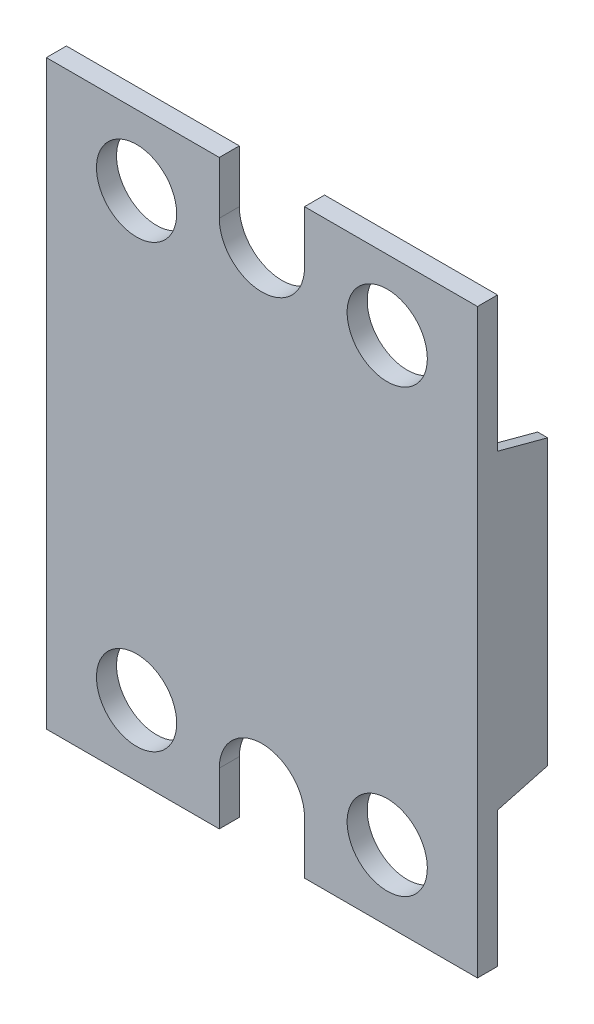
ISO-10303-21;
HEADER;
FILE_DESCRIPTION(('STEP AP214'),'2;1');
FILE_NAME('part.step','',(''),(''),'','','');
FILE_SCHEMA(('AUTOMOTIVE_DESIGN { 1 0 10303 214 1 1 1 1 }'));
ENDSEC;
DATA;
#1=APPLICATION_CONTEXT('core data for automotive mechanical design processes');
#2=APPLICATION_PROTOCOL_DEFINITION('international standard','automotive_design',2000,#1);
#3=PRODUCT_CONTEXT('',#1,'mechanical');
#4=PRODUCT('Part','Part','',(#3));
#5=PRODUCT_RELATED_PRODUCT_CATEGORY('part','',(#4));
#6=PRODUCT_DEFINITION_FORMATION('','',#4);
#7=PRODUCT_DEFINITION_CONTEXT('part definition',#1,'design');
#8=PRODUCT_DEFINITION('design','',#6,#7);
#9=PRODUCT_DEFINITION_SHAPE('','',#8);
#10=(LENGTH_UNIT() NAMED_UNIT(*) SI_UNIT(.MILLI.,.METRE.));
#11=(NAMED_UNIT(*) PLANE_ANGLE_UNIT() SI_UNIT($,.RADIAN.));
#12=(NAMED_UNIT(*) SI_UNIT($,.STERADIAN.) SOLID_ANGLE_UNIT());
#13=UNCERTAINTY_MEASURE_WITH_UNIT(LENGTH_MEASURE(1.E-05),#10,'distance_accuracy_value','');
#14=(GEOMETRIC_REPRESENTATION_CONTEXT(3) GLOBAL_UNCERTAINTY_ASSIGNED_CONTEXT((#13)) GLOBAL_UNIT_ASSIGNED_CONTEXT((#10,
#11,#12)) REPRESENTATION_CONTEXT('',''));
#15=CARTESIAN_POINT('',(0.,0.,0.));
#16=DIRECTION('',(0.,0.,1.));
#17=DIRECTION('',(1.,0.,0.));
#18=AXIS2_PLACEMENT_3D('',#15,#16,#17);
#19=CARTESIAN_POINT('',(0.,-23.75,-2.));
#20=DIRECTION('',(0.,0.,-1.));
#21=DIRECTION('',(-1.,0.,0.));
#22=AXIS2_PLACEMENT_3D('',#19,#20,#21);
#23=PLANE('',#22);
#24=CARTESIAN_POINT('',(12.5,22.,-2.));
#25=DIRECTION('',(0.,0.,1.));
#26=DIRECTION('',(1.,0.,0.));
#27=AXIS2_PLACEMENT_3D('',#24,#25,#26);
#28=CIRCLE('',#27,4.);
#29=CARTESIAN_POINT('',(16.5,22.,-2.));
#30=VERTEX_POINT('',#29);
#31=EDGE_CURVE('E290',#30,#30,#28,.T.);
#32=ORIENTED_EDGE('',*,*,#31,.T.);
#33=EDGE_LOOP('',(#32));
#34=FACE_BOUND('',#33,.T.);
#35=CARTESIAN_POINT('',(-12.5,22.,-2.));
#36=DIRECTION('',(0.,0.,1.));
#37=DIRECTION('',(1.,0.,0.));
#38=AXIS2_PLACEMENT_3D('',#35,#36,#37);
#39=CIRCLE('',#38,4.);
#40=CARTESIAN_POINT('',(-8.5,22.,-2.));
#41=VERTEX_POINT('',#40);
#42=EDGE_CURVE('E357',#41,#41,#39,.T.);
#43=ORIENTED_EDGE('',*,*,#42,.T.);
#44=EDGE_LOOP('',(#43));
#45=FACE_BOUND('',#44,.T.);
#46=CARTESIAN_POINT('',(-12.5,-22.,-2.));
#47=DIRECTION('',(0.,0.,1.));
#48=DIRECTION('',(1.,0.,0.));
#49=AXIS2_PLACEMENT_3D('',#46,#47,#48);
#50=CIRCLE('',#49,4.);
#51=CARTESIAN_POINT('',(-8.5,-22.,-2.));
#52=VERTEX_POINT('',#51);
#53=EDGE_CURVE('E351',#52,#52,#50,.T.);
#54=ORIENTED_EDGE('',*,*,#53,.T.);
#55=EDGE_LOOP('',(#54));
#56=FACE_BOUND('',#55,.T.);
#57=CARTESIAN_POINT('',(12.5,-22.,-2.));
#58=DIRECTION('',(0.,0.,1.));
#59=DIRECTION('',(1.,0.,0.));
#60=AXIS2_PLACEMENT_3D('',#57,#58,#59);
#61=CIRCLE('',#60,4.);
#62=CARTESIAN_POINT('',(16.5,-22.,-2.));
#63=VERTEX_POINT('',#62);
#64=EDGE_CURVE('E345',#63,#63,#61,.T.);
#65=ORIENTED_EDGE('',*,*,#64,.T.);
#66=EDGE_LOOP('',(#65));
#67=FACE_BOUND('',#66,.T.);
#68=DIRECTION('',(0.,-1.,0.));
#69=VECTOR('',#68,1.);
#70=CARTESIAN_POINT('',(-21.5,29.,-2.));
#71=LINE('',#70,#69);
#72=CARTESIAN_POINT('',(-21.5,-15.5,-2.));
#73=VERTEX_POINT('',#72);
#74=CARTESIAN_POINT('',(-21.5,-29.,-2.));
#75=VERTEX_POINT('',#74);
#76=EDGE_CURVE('E180',#73,#75,#71,.T.);
#77=ORIENTED_EDGE('',*,*,#76,.F.);
#78=DIRECTION('',(-1.,0.,0.));
#79=VECTOR('',#78,1.);
#80=CARTESIAN_POINT('',(-20.5,-15.5,-2.));
#81=LINE('',#80,#79);
#82=CARTESIAN_POINT('',(-20.5,-15.5,-2.));
#83=VERTEX_POINT('',#82);
#84=EDGE_CURVE('E33',#83,#73,#81,.T.);
#85=ORIENTED_EDGE('',*,*,#84,.F.);
#86=DIRECTION('',(0.,-1.,0.));
#87=VECTOR('',#86,1.);
#88=CARTESIAN_POINT('',(-20.5,-15.5,-2.));
#89=LINE('',#88,#87);
#90=CARTESIAN_POINT('',(-20.5,15.5,-2.));
#91=VERTEX_POINT('',#90);
#92=EDGE_CURVE('E175',#91,#83,#89,.T.);
#93=ORIENTED_EDGE('',*,*,#92,.F.);
#94=DIRECTION('',(-1.,0.,0.));
#95=VECTOR('',#94,1.);
#96=CARTESIAN_POINT('',(-20.5,15.5,-2.));
#97=LINE('',#96,#95);
#98=CARTESIAN_POINT('',(-21.5,15.5,-2.));
#99=VERTEX_POINT('',#98);
#100=EDGE_CURVE('E159',#91,#99,#97,.T.);
#101=ORIENTED_EDGE('',*,*,#100,.T.);
#102=CARTESIAN_POINT('',(-21.5,29.,-2.));
#103=VERTEX_POINT('',#102);
#104=EDGE_CURVE('E172',#103,#99,#71,.T.);
#105=ORIENTED_EDGE('',*,*,#104,.F.);
#106=DIRECTION('',(-1.,0.,0.));
#107=VECTOR('',#106,1.);
#108=CARTESIAN_POINT('',(-21.5,29.,-2.));
#109=LINE('',#108,#107);
#110=CARTESIAN_POINT('',(-4.25,29.,-2.));
#111=VERTEX_POINT('',#110);
#112=EDGE_CURVE('E215',#111,#103,#109,.T.);
#113=ORIENTED_EDGE('',*,*,#112,.F.);
#114=DIRECTION('',(0.,1.,0.));
#115=VECTOR('',#114,1.);
#116=CARTESIAN_POINT('',(-4.25,23.75,-2.));
#117=LINE('',#116,#115);
#118=CARTESIAN_POINT('',(-4.25,23.75,-2.));
#119=VERTEX_POINT('',#118);
#120=EDGE_CURVE('E235',#119,#111,#117,.T.);
#121=ORIENTED_EDGE('',*,*,#120,.F.);
#122=CARTESIAN_POINT('',(0.,23.75,-2.));
#123=DIRECTION('',(0.,0.,-1.));
#124=DIRECTION('',(1.,0.,0.));
#125=AXIS2_PLACEMENT_3D('',#122,#123,#124);
#126=CIRCLE('',#125,4.25);
#127=CARTESIAN_POINT('',(4.25,23.75,-2.));
#128=VERTEX_POINT('',#127);
#129=EDGE_CURVE('E238',#128,#119,#126,.T.);
#130=ORIENTED_EDGE('',*,*,#129,.F.);
#131=DIRECTION('',(0.,-1.,0.));
#132=VECTOR('',#131,1.);
#133=CARTESIAN_POINT('',(4.25,23.75,-2.));
#134=LINE('',#133,#132);
#135=CARTESIAN_POINT('',(4.25,29.,-2.));
#136=VERTEX_POINT('',#135);
#137=EDGE_CURVE('E240',#136,#128,#134,.T.);
#138=ORIENTED_EDGE('',*,*,#137,.F.);
#139=DIRECTION('',(-1.,0.,0.));
#140=VECTOR('',#139,1.);
#141=CARTESIAN_POINT('',(4.25,29.,-2.));
#142=LINE('',#141,#140);
#143=CARTESIAN_POINT('',(21.5,29.,-2.));
#144=VERTEX_POINT('',#143);
#145=EDGE_CURVE('E203',#144,#136,#142,.T.);
#146=ORIENTED_EDGE('',*,*,#145,.F.);
#147=DIRECTION('',(0.,1.,0.));
#148=VECTOR('',#147,1.);
#149=CARTESIAN_POINT('',(21.5,29.,-2.));
#150=LINE('',#149,#148);
#151=CARTESIAN_POINT('',(21.5,15.5,-2.));
#152=VERTEX_POINT('',#151);
#153=EDGE_CURVE('E200',#152,#144,#150,.T.);
#154=ORIENTED_EDGE('',*,*,#153,.F.);
#155=DIRECTION('',(1.,0.,0.));
#156=VECTOR('',#155,1.);
#157=CARTESIAN_POINT('',(20.5,15.5,-2.));
#158=LINE('',#157,#156);
#159=CARTESIAN_POINT('',(20.5,15.5,-2.));
#160=VERTEX_POINT('',#159);
#161=EDGE_CURVE('E329',#160,#152,#158,.T.);
#162=ORIENTED_EDGE('',*,*,#161,.F.);
#163=DIRECTION('',(0.,-1.,0.));
#164=VECTOR('',#163,1.);
#165=CARTESIAN_POINT('',(20.5,-15.5,-2.));
#166=LINE('',#165,#164);
#167=CARTESIAN_POINT('',(20.5,-15.5,-2.));
#168=VERTEX_POINT('',#167);
#169=EDGE_CURVE('E321',#160,#168,#166,.T.);
#170=ORIENTED_EDGE('',*,*,#169,.T.);
#171=DIRECTION('',(1.,0.,0.));
#172=VECTOR('',#171,1.);
#173=CARTESIAN_POINT('',(20.5,-15.5,-2.));
#174=LINE('',#173,#172);
#175=CARTESIAN_POINT('',(21.5,-15.5,-2.));
#176=VERTEX_POINT('',#175);
#177=EDGE_CURVE('E333',#168,#176,#174,.T.);
#178=ORIENTED_EDGE('',*,*,#177,.T.);
#179=CARTESIAN_POINT('',(21.5,-29.,-2.));
#180=VERTEX_POINT('',#179);
#181=EDGE_CURVE('E209',#180,#176,#150,.T.);
#182=ORIENTED_EDGE('',*,*,#181,.F.);
#183=DIRECTION('',(1.,0.,0.));
#184=VECTOR('',#183,1.);
#185=CARTESIAN_POINT('',(4.25,-29.,-2.));
#186=LINE('',#185,#184);
#187=CARTESIAN_POINT('',(4.25,-29.,-2.));
#188=VERTEX_POINT('',#187);
#189=EDGE_CURVE('E197',#188,#180,#186,.T.);
#190=ORIENTED_EDGE('',*,*,#189,.F.);
#191=DIRECTION('',(0.,-1.,0.));
#192=VECTOR('',#191,1.);
#193=CARTESIAN_POINT('',(4.25,-23.75,-2.));
#194=LINE('',#193,#192);
#195=CARTESIAN_POINT('',(4.25,-23.75,-2.));
#196=VERTEX_POINT('',#195);
#197=EDGE_CURVE('E194',#196,#188,#194,.T.);
#198=ORIENTED_EDGE('',*,*,#197,.F.);
#199=CARTESIAN_POINT('',(0.,-23.75,-2.));
#200=DIRECTION('',(0.,0.,-1.));
#201=DIRECTION('',(-1.,0.,0.));
#202=AXIS2_PLACEMENT_3D('',#199,#200,#201);
#203=CIRCLE('',#202,4.25);
#204=CARTESIAN_POINT('',(-4.25,-23.75,-2.));
#205=VERTEX_POINT('',#204);
#206=EDGE_CURVE('E191',#205,#196,#203,.T.);
#207=ORIENTED_EDGE('',*,*,#206,.F.);
#208=DIRECTION('',(0.,1.,0.));
#209=VECTOR('',#208,1.);
#210=CARTESIAN_POINT('',(-4.25,-23.75,-2.));
#211=LINE('',#210,#209);
#212=CARTESIAN_POINT('',(-4.25,-29.,-2.));
#213=VERTEX_POINT('',#212);
#214=EDGE_CURVE('E183',#213,#205,#211,.T.);
#215=ORIENTED_EDGE('',*,*,#214,.F.);
#216=DIRECTION('',(1.,0.,0.));
#217=VECTOR('',#216,1.);
#218=CARTESIAN_POINT('',(-21.5,-29.,-2.));
#219=LINE('',#218,#217);
#220=EDGE_CURVE('E179',#75,#213,#219,.T.);
#221=ORIENTED_EDGE('',*,*,#220,.F.);
#222=EDGE_LOOP('',(#77,#85,#93,#101,#105,#113,#121,#130,#138,#146,#154,#162,#170,#178,#182,#190,
#198,#207,#215,#221));
#223=FACE_BOUND('',#222,.T.);
#224=ADVANCED_FACE('F16',(#34,#45,#56,#67,#223),#23,.T.);
#225=CARTESIAN_POINT('',(-21.5,29.,-2.));
#226=DIRECTION('',(-1.,0.,0.));
#227=DIRECTION('',(0.,0.,1.));
#228=AXIS2_PLACEMENT_3D('',#225,#226,#227);
#229=PLANE('',#228);
#230=DIRECTION('',(0.,-1.,0.));
#231=VECTOR('',#230,1.);
#232=CARTESIAN_POINT('',(-21.5,29.,0.));
#233=LINE('',#232,#231);
#234=CARTESIAN_POINT('',(-21.5,29.,0.));
#235=VERTEX_POINT('',#234);
#236=CARTESIAN_POINT('',(-21.5,-29.,0.));
#237=VERTEX_POINT('',#236);
#238=EDGE_CURVE('E284',#235,#237,#233,.T.);
#239=ORIENTED_EDGE('',*,*,#238,.F.);
#240=DIRECTION('',(0.,0.,1.));
#241=VECTOR('',#240,1.);
#242=CARTESIAN_POINT('',(-21.5,29.,-2.));
#243=LINE('',#242,#241);
#244=EDGE_CURVE('E10',#103,#235,#243,.T.);
#245=ORIENTED_EDGE('',*,*,#244,.F.);
#246=ORIENTED_EDGE('',*,*,#104,.T.);
#247=DIRECTION('',(0.,0.258819045102521,0.965925826289068));
#248=VECTOR('',#247,1.);
#249=CARTESIAN_POINT('',(-21.5,15.5,-2.));
#250=LINE('',#249,#248);
#251=CARTESIAN_POINT('',(-21.5,14.1602540378444,-7.));
#252=VERTEX_POINT('',#251);
#253=EDGE_CURVE('E155',#252,#99,#250,.T.);
#254=ORIENTED_EDGE('',*,*,#253,.F.);
#255=DIRECTION('',(0.,1.,0.));
#256=VECTOR('',#255,1.);
#257=CARTESIAN_POINT('',(-21.5,14.1602540378444,-7.));
#258=LINE('',#257,#256);
#259=CARTESIAN_POINT('',(-21.5,-14.1602540378444,-7.));
#260=VERTEX_POINT('',#259);
#261=EDGE_CURVE('E166',#260,#252,#258,.T.);
#262=ORIENTED_EDGE('',*,*,#261,.F.);
#263=DIRECTION('',(0.,0.258819045102521,-0.965925826289068));
#264=VECTOR('',#263,1.);
#265=CARTESIAN_POINT('',(-21.5,-14.1602540378444,-7.));
#266=LINE('',#265,#264);
#267=EDGE_CURVE('E646',#73,#260,#266,.T.);
#268=ORIENTED_EDGE('',*,*,#267,.F.);
#269=ORIENTED_EDGE('',*,*,#76,.T.);
#270=DIRECTION('',(0.,0.,1.));
#271=VECTOR('',#270,1.);
#272=CARTESIAN_POINT('',(-21.5,-29.,-2.));
#273=LINE('',#272,#271);
#274=EDGE_CURVE('E212',#75,#237,#273,.T.);
#275=ORIENTED_EDGE('',*,*,#274,.T.);
#276=EDGE_LOOP('',(#239,#245,#246,#254,#262,#268,#269,#275));
#277=FACE_BOUND('',#276,.T.);
#278=ADVANCED_FACE('F18',(#277),#229,.T.);
#279=CARTESIAN_POINT('',(-21.5,29.,-2.));
#280=DIRECTION('',(0.,1.,0.));
#281=DIRECTION('',(0.,0.,1.));
#282=AXIS2_PLACEMENT_3D('',#279,#280,#281);
#283=PLANE('',#282);
#284=DIRECTION('',(-1.,0.,0.));
#285=VECTOR('',#284,1.);
#286=CARTESIAN_POINT('',(-21.5,29.,0.));
#287=LINE('',#286,#285);
#288=CARTESIAN_POINT('',(-4.25,29.,0.));
#289=VERTEX_POINT('',#288);
#290=EDGE_CURVE('E185',#289,#235,#287,.T.);
#291=ORIENTED_EDGE('',*,*,#290,.F.);
#292=DIRECTION('',(0.,0.,1.));
#293=VECTOR('',#292,1.);
#294=CARTESIAN_POINT('',(-4.25,29.,-2.));
#295=LINE('',#294,#293);
#296=EDGE_CURVE('E25',#111,#289,#295,.T.);
#297=ORIENTED_EDGE('',*,*,#296,.F.);
#298=ORIENTED_EDGE('',*,*,#112,.T.);
#299=ORIENTED_EDGE('',*,*,#244,.T.);
#300=EDGE_LOOP('',(#291,#297,#298,#299));
#301=FACE_BOUND('',#300,.T.);
#302=ADVANCED_FACE('F286',(#301),#283,.T.);
#303=CARTESIAN_POINT('',(-4.25,23.75,-2.));
#304=DIRECTION('',(1.,0.,0.));
#305=DIRECTION('',(0.,0.,-1.));
#306=AXIS2_PLACEMENT_3D('',#303,#304,#305);
#307=PLANE('',#306);
#308=DIRECTION('',(0.,1.,0.));
#309=VECTOR('',#308,1.);
#310=CARTESIAN_POINT('',(-4.25,23.75,0.));
#311=LINE('',#310,#309);
#312=CARTESIAN_POINT('',(-4.25,23.75,0.));
#313=VERTEX_POINT('',#312);
#314=EDGE_CURVE('E279',#313,#289,#311,.T.);
#315=ORIENTED_EDGE('',*,*,#314,.F.);
#316=DIRECTION('',(0.,0.,1.));
#317=VECTOR('',#316,1.);
#318=CARTESIAN_POINT('',(-4.25,23.75,-2.));
#319=LINE('',#318,#317);
#320=EDGE_CURVE('E231',#119,#313,#319,.T.);
#321=ORIENTED_EDGE('',*,*,#320,.F.);
#322=ORIENTED_EDGE('',*,*,#120,.T.);
#323=ORIENTED_EDGE('',*,*,#296,.T.);
#324=EDGE_LOOP('',(#315,#321,#322,#323));
#325=FACE_BOUND('',#324,.T.);
#326=ADVANCED_FACE('F390',(#325),#307,.T.);
#327=CARTESIAN_POINT('',(0.,23.75,-2.));
#328=DIRECTION('',(0.,0.,1.));
#329=DIRECTION('',(1.,0.,0.));
#330=AXIS2_PLACEMENT_3D('',#327,#328,#329);
#331=CYLINDRICAL_SURFACE('',#330,4.25);
#332=CARTESIAN_POINT('',(0.,23.75,0.));
#333=DIRECTION('',(0.,0.,-1.));
#334=DIRECTION('',(1.,0.,0.));
#335=AXIS2_PLACEMENT_3D('',#332,#333,#334);
#336=CIRCLE('',#335,4.25);
#337=CARTESIAN_POINT('',(4.25,23.75,0.));
#338=VERTEX_POINT('',#337);
#339=EDGE_CURVE('E260',#338,#313,#336,.T.);
#340=ORIENTED_EDGE('',*,*,#339,.F.);
#341=DIRECTION('',(0.,0.,1.));
#342=VECTOR('',#341,1.);
#343=CARTESIAN_POINT('',(4.25,23.75,-2.));
#344=LINE('',#343,#342);
#345=EDGE_CURVE('E229',#128,#338,#344,.T.);
#346=ORIENTED_EDGE('',*,*,#345,.F.);
#347=ORIENTED_EDGE('',*,*,#129,.T.);
#348=ORIENTED_EDGE('',*,*,#320,.T.);
#349=EDGE_LOOP('',(#340,#346,#347,#348));
#350=FACE_BOUND('',#349,.T.);
#351=ADVANCED_FACE('F257',(#350),#331,.F.);
#352=CARTESIAN_POINT('',(4.25,23.75,-2.));
#353=DIRECTION('',(-1.,0.,0.));
#354=DIRECTION('',(0.,0.,1.));
#355=AXIS2_PLACEMENT_3D('',#352,#353,#354);
#356=PLANE('',#355);
#357=DIRECTION('',(0.,-1.,0.));
#358=VECTOR('',#357,1.);
#359=CARTESIAN_POINT('',(4.25,23.75,0.));
#360=LINE('',#359,#358);
#361=CARTESIAN_POINT('',(4.25,29.,0.));
#362=VERTEX_POINT('',#361);
#363=EDGE_CURVE('E263',#362,#338,#360,.T.);
#364=ORIENTED_EDGE('',*,*,#363,.F.);
#365=DIRECTION('',(0.,0.,1.));
#366=VECTOR('',#365,1.);
#367=CARTESIAN_POINT('',(4.25,29.,-2.));
#368=LINE('',#367,#366);
#369=EDGE_CURVE('E227',#136,#362,#368,.T.);
#370=ORIENTED_EDGE('',*,*,#369,.F.);
#371=ORIENTED_EDGE('',*,*,#137,.T.);
#372=ORIENTED_EDGE('',*,*,#345,.T.);
#373=EDGE_LOOP('',(#364,#370,#371,#372));
#374=FACE_BOUND('',#373,.T.);
#375=ADVANCED_FACE('F262',(#374),#356,.T.);
#376=CARTESIAN_POINT('',(4.25,29.,-2.));
#377=DIRECTION('',(0.,1.,0.));
#378=DIRECTION('',(0.,0.,1.));
#379=AXIS2_PLACEMENT_3D('',#376,#377,#378);
#380=PLANE('',#379);
#381=DIRECTION('',(-1.,0.,0.));
#382=VECTOR('',#381,1.);
#383=CARTESIAN_POINT('',(4.25,29.,0.));
#384=LINE('',#383,#382);
#385=CARTESIAN_POINT('',(21.5,29.,0.));
#386=VERTEX_POINT('',#385);
#387=EDGE_CURVE('E266',#386,#362,#384,.T.);
#388=ORIENTED_EDGE('',*,*,#387,.F.);
#389=DIRECTION('',(0.,0.,1.));
#390=VECTOR('',#389,1.);
#391=CARTESIAN_POINT('',(21.5,29.,-2.));
#392=LINE('',#391,#390);
#393=EDGE_CURVE('E225',#144,#386,#392,.T.);
#394=ORIENTED_EDGE('',*,*,#393,.F.);
#395=ORIENTED_EDGE('',*,*,#145,.T.);
#396=ORIENTED_EDGE('',*,*,#369,.T.);
#397=EDGE_LOOP('',(#388,#394,#395,#396));
#398=FACE_BOUND('',#397,.T.);
#399=ADVANCED_FACE('F249',(#398),#380,.T.);
#400=CARTESIAN_POINT('',(21.5,29.,-2.));
#401=DIRECTION('',(1.,0.,0.));
#402=DIRECTION('',(0.,0.,-1.));
#403=AXIS2_PLACEMENT_3D('',#400,#401,#402);
#404=PLANE('',#403);
#405=DIRECTION('',(0.,1.,0.));
#406=VECTOR('',#405,1.);
#407=CARTESIAN_POINT('',(21.5,29.,0.));
#408=LINE('',#407,#406);
#409=CARTESIAN_POINT('',(21.5,-29.,0.));
#410=VERTEX_POINT('',#409);
#411=EDGE_CURVE('E273',#410,#386,#408,.T.);
#412=ORIENTED_EDGE('',*,*,#411,.F.);
#413=DIRECTION('',(0.,0.,1.));
#414=VECTOR('',#413,1.);
#415=CARTESIAN_POINT('',(21.5,-29.,-2.));
#416=LINE('',#415,#414);
#417=EDGE_CURVE('E223',#180,#410,#416,.T.);
#418=ORIENTED_EDGE('',*,*,#417,.F.);
#419=ORIENTED_EDGE('',*,*,#181,.T.);
#420=DIRECTION('',(0.,0.258819045102521,-0.965925826289068));
#421=VECTOR('',#420,1.);
#422=CARTESIAN_POINT('',(21.5,-14.1602540378444,-7.));
#423=LINE('',#422,#421);
#424=CARTESIAN_POINT('',(21.5,-14.1602540378444,-7.));
#425=VERTEX_POINT('',#424);
#426=EDGE_CURVE('E41',#176,#425,#423,.T.);
#427=ORIENTED_EDGE('',*,*,#426,.T.);
#428=DIRECTION('',(0.,1.,0.));
#429=VECTOR('',#428,1.);
#430=CARTESIAN_POINT('',(21.5,14.1602540378444,-7.));
#431=LINE('',#430,#429);
#432=CARTESIAN_POINT('',(21.5,14.1602540378444,-7.));
#433=VERTEX_POINT('',#432);
#434=EDGE_CURVE('E319',#425,#433,#431,.T.);
#435=ORIENTED_EDGE('',*,*,#434,.T.);
#436=DIRECTION('',(0.,0.258819045102521,0.965925826289068));
#437=VECTOR('',#436,1.);
#438=CARTESIAN_POINT('',(21.5,15.5,-2.));
#439=LINE('',#438,#437);
#440=EDGE_CURVE('E317',#433,#152,#439,.T.);
#441=ORIENTED_EDGE('',*,*,#440,.T.);
#442=ORIENTED_EDGE('',*,*,#153,.T.);
#443=ORIENTED_EDGE('',*,*,#393,.T.);
#444=EDGE_LOOP('',(#412,#418,#419,#427,#435,#441,#442,#443));
#445=FACE_BOUND('',#444,.T.);
#446=ADVANCED_FACE('F313',(#445),#404,.T.);
#447=CARTESIAN_POINT('',(4.25,-29.,-2.));
#448=DIRECTION('',(0.,-1.,0.));
#449=DIRECTION('',(0.,0.,-1.));
#450=AXIS2_PLACEMENT_3D('',#447,#448,#449);
#451=PLANE('',#450);
#452=DIRECTION('',(1.,0.,0.));
#453=VECTOR('',#452,1.);
#454=CARTESIAN_POINT('',(4.25,-29.,0.));
#455=LINE('',#454,#453);
#456=CARTESIAN_POINT('',(4.25,-29.,0.));
#457=VERTEX_POINT('',#456);
#458=EDGE_CURVE('E275',#457,#410,#455,.T.);
#459=ORIENTED_EDGE('',*,*,#458,.F.);
#460=DIRECTION('',(0.,0.,1.));
#461=VECTOR('',#460,1.);
#462=CARTESIAN_POINT('',(4.25,-29.,-2.));
#463=LINE('',#462,#461);
#464=EDGE_CURVE('E221',#188,#457,#463,.T.);
#465=ORIENTED_EDGE('',*,*,#464,.F.);
#466=ORIENTED_EDGE('',*,*,#189,.T.);
#467=ORIENTED_EDGE('',*,*,#417,.T.);
#468=EDGE_LOOP('',(#459,#465,#466,#467));
#469=FACE_BOUND('',#468,.T.);
#470=ADVANCED_FACE('F309',(#469),#451,.T.);
#471=CARTESIAN_POINT('',(4.25,-23.75,-2.));
#472=DIRECTION('',(-1.,0.,0.));
#473=DIRECTION('',(0.,0.,1.));
#474=AXIS2_PLACEMENT_3D('',#471,#472,#473);
#475=PLANE('',#474);
#476=DIRECTION('',(0.,-1.,0.));
#477=VECTOR('',#476,1.);
#478=CARTESIAN_POINT('',(4.25,-23.75,0.));
#479=LINE('',#478,#477);
#480=CARTESIAN_POINT('',(4.25,-23.75,0.));
#481=VERTEX_POINT('',#480);
#482=EDGE_CURVE('E304',#481,#457,#479,.T.);
#483=ORIENTED_EDGE('',*,*,#482,.F.);
#484=DIRECTION('',(0.,0.,1.));
#485=VECTOR('',#484,1.);
#486=CARTESIAN_POINT('',(4.25,-23.75,-2.));
#487=LINE('',#486,#485);
#488=EDGE_CURVE('E219',#196,#481,#487,.T.);
#489=ORIENTED_EDGE('',*,*,#488,.F.);
#490=ORIENTED_EDGE('',*,*,#197,.T.);
#491=ORIENTED_EDGE('',*,*,#464,.T.);
#492=EDGE_LOOP('',(#483,#489,#490,#491));
#493=FACE_BOUND('',#492,.T.);
#494=ADVANCED_FACE('F404',(#493),#475,.T.);
#495=CARTESIAN_POINT('',(0.,-23.75,-2.));
#496=DIRECTION('',(0.,0.,1.));
#497=DIRECTION('',(1.,0.,0.));
#498=AXIS2_PLACEMENT_3D('',#495,#496,#497);
#499=CYLINDRICAL_SURFACE('',#498,4.25);
#500=CARTESIAN_POINT('',(0.,-23.75,0.));
#501=DIRECTION('',(0.,0.,-1.));
#502=DIRECTION('',(-1.,0.,0.));
#503=AXIS2_PLACEMENT_3D('',#500,#501,#502);
#504=CIRCLE('',#503,4.25);
#505=CARTESIAN_POINT('',(-4.25,-23.75,0.));
#506=VERTEX_POINT('',#505);
#507=EDGE_CURVE('E301',#506,#481,#504,.T.);
#508=ORIENTED_EDGE('',*,*,#507,.F.);
#509=DIRECTION('',(0.,0.,1.));
#510=VECTOR('',#509,1.);
#511=CARTESIAN_POINT('',(-4.25,-23.75,-2.));
#512=LINE('',#511,#510);
#513=EDGE_CURVE('E217',#205,#506,#512,.T.);
#514=ORIENTED_EDGE('',*,*,#513,.F.);
#515=ORIENTED_EDGE('',*,*,#206,.T.);
#516=ORIENTED_EDGE('',*,*,#488,.T.);
#517=EDGE_LOOP('',(#508,#514,#515,#516));
#518=FACE_BOUND('',#517,.T.);
#519=ADVANCED_FACE('F407',(#518),#499,.F.);
#520=CARTESIAN_POINT('',(-4.25,-23.75,-2.));
#521=DIRECTION('',(1.,0.,0.));
#522=DIRECTION('',(0.,0.,-1.));
#523=AXIS2_PLACEMENT_3D('',#520,#521,#522);
#524=PLANE('',#523);
#525=DIRECTION('',(0.,1.,0.));
#526=VECTOR('',#525,1.);
#527=CARTESIAN_POINT('',(-4.25,-23.75,0.));
#528=LINE('',#527,#526);
#529=CARTESIAN_POINT('',(-4.25,-29.,0.));
#530=VERTEX_POINT('',#529);
#531=EDGE_CURVE('E292',#530,#506,#528,.T.);
#532=ORIENTED_EDGE('',*,*,#531,.F.);
#533=DIRECTION('',(0.,0.,1.));
#534=VECTOR('',#533,1.);
#535=CARTESIAN_POINT('',(-4.25,-29.,-2.));
#536=LINE('',#535,#534);
#537=EDGE_CURVE('E214',#213,#530,#536,.T.);
#538=ORIENTED_EDGE('',*,*,#537,.F.);
#539=ORIENTED_EDGE('',*,*,#214,.T.);
#540=ORIENTED_EDGE('',*,*,#513,.T.);
#541=EDGE_LOOP('',(#532,#538,#539,#540));
#542=FACE_BOUND('',#541,.T.);
#543=ADVANCED_FACE('F376',(#542),#524,.T.);
#544=CARTESIAN_POINT('',(-21.5,-29.,-2.));
#545=DIRECTION('',(0.,-1.,0.));
#546=DIRECTION('',(0.,0.,-1.));
#547=AXIS2_PLACEMENT_3D('',#544,#545,#546);
#548=PLANE('',#547);
#549=DIRECTION('',(1.,0.,0.));
#550=VECTOR('',#549,1.);
#551=CARTESIAN_POINT('',(-21.5,-29.,0.));
#552=LINE('',#551,#550);
#553=EDGE_CURVE('E289',#237,#530,#552,.T.);
#554=ORIENTED_EDGE('',*,*,#553,.F.);
#555=ORIENTED_EDGE('',*,*,#274,.F.);
#556=ORIENTED_EDGE('',*,*,#220,.T.);
#557=ORIENTED_EDGE('',*,*,#537,.T.);
#558=EDGE_LOOP('',(#554,#555,#556,#557));
#559=FACE_BOUND('',#558,.T.);
#560=ADVANCED_FACE('F365',(#559),#548,.T.);
#561=CARTESIAN_POINT('',(0.,-23.75,0.));
#562=DIRECTION('',(0.,0.,-1.));
#563=DIRECTION('',(-1.,0.,0.));
#564=AXIS2_PLACEMENT_3D('',#561,#562,#563);
#565=PLANE('',#564);
#566=CARTESIAN_POINT('',(12.5,-22.,0.));
#567=DIRECTION('',(0.,0.,1.));
#568=DIRECTION('',(1.,0.,0.));
#569=AXIS2_PLACEMENT_3D('',#566,#567,#568);
#570=CIRCLE('',#569,4.);
#571=CARTESIAN_POINT('',(16.5,-22.,0.));
#572=VERTEX_POINT('',#571);
#573=EDGE_CURVE('E331',#572,#572,#570,.T.);
#574=ORIENTED_EDGE('',*,*,#573,.F.);
#575=EDGE_LOOP('',(#574));
#576=FACE_BOUND('',#575,.T.);
#577=CARTESIAN_POINT('',(-12.5,-22.,0.));
#578=DIRECTION('',(0.,0.,1.));
#579=DIRECTION('',(1.,0.,0.));
#580=AXIS2_PLACEMENT_3D('',#577,#578,#579);
#581=CIRCLE('',#580,4.);
#582=CARTESIAN_POINT('',(-8.5,-22.,0.));
#583=VERTEX_POINT('',#582);
#584=EDGE_CURVE('E348',#583,#583,#581,.T.);
#585=ORIENTED_EDGE('',*,*,#584,.F.);
#586=EDGE_LOOP('',(#585));
#587=FACE_BOUND('',#586,.T.);
#588=CARTESIAN_POINT('',(-12.5,22.,0.));
#589=DIRECTION('',(0.,0.,1.));
#590=DIRECTION('',(1.,0.,0.));
#591=AXIS2_PLACEMENT_3D('',#588,#589,#590);
#592=CIRCLE('',#591,4.);
#593=CARTESIAN_POINT('',(-8.5,22.,0.));
#594=VERTEX_POINT('',#593);
#595=EDGE_CURVE('E354',#594,#594,#592,.T.);
#596=ORIENTED_EDGE('',*,*,#595,.F.);
#597=EDGE_LOOP('',(#596));
#598=FACE_BOUND('',#597,.T.);
#599=CARTESIAN_POINT('',(12.5,22.,0.));
#600=DIRECTION('',(0.,0.,1.));
#601=DIRECTION('',(1.,0.,0.));
#602=AXIS2_PLACEMENT_3D('',#599,#600,#601);
#603=CIRCLE('',#602,4.);
#604=CARTESIAN_POINT('',(16.5,22.,0.));
#605=VERTEX_POINT('',#604);
#606=EDGE_CURVE('E295',#605,#605,#603,.T.);
#607=ORIENTED_EDGE('',*,*,#606,.F.);
#608=EDGE_LOOP('',(#607));
#609=FACE_BOUND('',#608,.T.);
#610=ORIENTED_EDGE('',*,*,#238,.T.);
#611=ORIENTED_EDGE('',*,*,#553,.T.);
#612=ORIENTED_EDGE('',*,*,#531,.T.);
#613=ORIENTED_EDGE('',*,*,#507,.T.);
#614=ORIENTED_EDGE('',*,*,#482,.T.);
#615=ORIENTED_EDGE('',*,*,#458,.T.);
#616=ORIENTED_EDGE('',*,*,#411,.T.);
#617=ORIENTED_EDGE('',*,*,#387,.T.);
#618=ORIENTED_EDGE('',*,*,#363,.T.);
#619=ORIENTED_EDGE('',*,*,#339,.T.);
#620=ORIENTED_EDGE('',*,*,#314,.T.);
#621=ORIENTED_EDGE('',*,*,#290,.T.);
#622=EDGE_LOOP('',(#610,#611,#612,#613,#614,#615,#616,#617,#618,#619,#620,#621));
#623=FACE_BOUND('',#622,.T.);
#624=ADVANCED_FACE('F270',(#576,#587,#598,#609,#623),#565,.F.);
#625=CARTESIAN_POINT('',(12.5,22.,-2.));
#626=DIRECTION('',(0.,0.,1.));
#627=DIRECTION('',(1.,0.,0.));
#628=AXIS2_PLACEMENT_3D('',#625,#626,#627);
#629=CYLINDRICAL_SURFACE('',#628,4.);
#630=ORIENTED_EDGE('',*,*,#31,.F.);
#631=EDGE_LOOP('',(#630));
#632=FACE_BOUND('',#631,.T.);
#633=ORIENTED_EDGE('',*,*,#606,.T.);
#634=EDGE_LOOP('',(#633));
#635=FACE_BOUND('',#634,.T.);
#636=ADVANCED_FACE('F362',(#632,#635),#629,.F.);
#637=CARTESIAN_POINT('',(-12.5,22.,-2.));
#638=DIRECTION('',(0.,0.,1.));
#639=DIRECTION('',(1.,0.,0.));
#640=AXIS2_PLACEMENT_3D('',#637,#638,#639);
#641=CYLINDRICAL_SURFACE('',#640,4.);
#642=ORIENTED_EDGE('',*,*,#42,.F.);
#643=EDGE_LOOP('',(#642));
#644=FACE_BOUND('',#643,.T.);
#645=ORIENTED_EDGE('',*,*,#595,.T.);
#646=EDGE_LOOP('',(#645));
#647=FACE_BOUND('',#646,.T.);
#648=ADVANCED_FACE('F373',(#644,#647),#641,.F.);
#649=CARTESIAN_POINT('',(-12.5,-22.,-2.));
#650=DIRECTION('',(0.,0.,1.));
#651=DIRECTION('',(1.,0.,0.));
#652=AXIS2_PLACEMENT_3D('',#649,#650,#651);
#653=CYLINDRICAL_SURFACE('',#652,4.);
#654=ORIENTED_EDGE('',*,*,#53,.F.);
#655=EDGE_LOOP('',(#654));
#656=FACE_BOUND('',#655,.T.);
#657=ORIENTED_EDGE('',*,*,#584,.T.);
#658=EDGE_LOOP('',(#657));
#659=FACE_BOUND('',#658,.T.);
#660=ADVANCED_FACE('F456',(#656,#659),#653,.F.);
#661=CARTESIAN_POINT('',(12.5,-22.,-2.));
#662=DIRECTION('',(0.,0.,1.));
#663=DIRECTION('',(1.,0.,0.));
#664=AXIS2_PLACEMENT_3D('',#661,#662,#663);
#665=CYLINDRICAL_SURFACE('',#664,4.);
#666=ORIENTED_EDGE('',*,*,#64,.F.);
#667=EDGE_LOOP('',(#666));
#668=FACE_BOUND('',#667,.T.);
#669=ORIENTED_EDGE('',*,*,#573,.T.);
#670=EDGE_LOOP('',(#669));
#671=FACE_BOUND('',#670,.T.);
#672=ADVANCED_FACE('F450',(#668,#671),#665,.F.);
#673=CARTESIAN_POINT('',(20.5,15.5,-2.));
#674=DIRECTION('',(0.,0.965925826289069,-0.258819045102521));
#675=DIRECTION('',(0.,0.258819045102521,0.965925826289069));
#676=AXIS2_PLACEMENT_3D('',#673,#674,#675);
#677=PLANE('',#676);
#678=ORIENTED_EDGE('',*,*,#440,.F.);
#679=DIRECTION('',(1.,0.,0.));
#680=VECTOR('',#679,1.);
#681=CARTESIAN_POINT('',(20.5,14.1602540378444,-7.));
#682=LINE('',#681,#680);
#683=CARTESIAN_POINT('',(20.5,14.1602540378444,-7.));
#684=VERTEX_POINT('',#683);
#685=EDGE_CURVE('E332',#684,#433,#682,.T.);
#686=ORIENTED_EDGE('',*,*,#685,.F.);
#687=DIRECTION('',(0.,0.258819045102521,0.965925826289068));
#688=VECTOR('',#687,1.);
#689=CARTESIAN_POINT('',(20.5,15.5,-2.));
#690=LINE('',#689,#688);
#691=EDGE_CURVE('E337',#684,#160,#690,.T.);
#692=ORIENTED_EDGE('',*,*,#691,.T.);
#693=ORIENTED_EDGE('',*,*,#161,.T.);
#694=EDGE_LOOP('',(#678,#686,#692,#693));
#695=FACE_BOUND('',#694,.T.);
#696=ADVANCED_FACE('F442',(#695),#677,.T.);
#697=CARTESIAN_POINT('',(20.5,14.1602540378444,-7.));
#698=DIRECTION('',(0.,0.,-1.));
#699=DIRECTION('',(-1.,0.,0.));
#700=AXIS2_PLACEMENT_3D('',#697,#698,#699);
#701=PLANE('',#700);
#702=ORIENTED_EDGE('',*,*,#434,.F.);
#703=DIRECTION('',(1.,0.,0.));
#704=VECTOR('',#703,1.);
#705=CARTESIAN_POINT('',(20.5,-14.1602540378444,-7.));
#706=LINE('',#705,#704);
#707=CARTESIAN_POINT('',(20.5,-14.1602540378444,-7.));
#708=VERTEX_POINT('',#707);
#709=EDGE_CURVE('E336',#708,#425,#706,.T.);
#710=ORIENTED_EDGE('',*,*,#709,.F.);
#711=DIRECTION('',(0.,1.,0.));
#712=VECTOR('',#711,1.);
#713=CARTESIAN_POINT('',(20.5,14.1602540378444,-7.));
#714=LINE('',#713,#712);
#715=EDGE_CURVE('E432',#708,#684,#714,.T.);
#716=ORIENTED_EDGE('',*,*,#715,.T.);
#717=ORIENTED_EDGE('',*,*,#685,.T.);
#718=EDGE_LOOP('',(#702,#710,#716,#717));
#719=FACE_BOUND('',#718,.T.);
#720=ADVANCED_FACE('F440',(#719),#701,.T.);
#721=CARTESIAN_POINT('',(20.5,-14.1602540378444,-7.));
#722=DIRECTION('',(0.,-0.965925826289069,-0.258819045102521));
#723=DIRECTION('',(0.,0.258819045102521,-0.965925826289069));
#724=AXIS2_PLACEMENT_3D('',#721,#722,#723);
#725=PLANE('',#724);
#726=ORIENTED_EDGE('',*,*,#426,.F.);
#727=ORIENTED_EDGE('',*,*,#177,.F.);
#728=DIRECTION('',(0.,0.258819045102521,-0.965925826289068));
#729=VECTOR('',#728,1.);
#730=CARTESIAN_POINT('',(20.5,-14.1602540378444,-7.));
#731=LINE('',#730,#729);
#732=EDGE_CURVE('E323',#168,#708,#731,.T.);
#733=ORIENTED_EDGE('',*,*,#732,.T.);
#734=ORIENTED_EDGE('',*,*,#709,.T.);
#735=EDGE_LOOP('',(#726,#727,#733,#734));
#736=FACE_BOUND('',#735,.T.);
#737=ADVANCED_FACE('F437',(#736),#725,.T.);
#738=CARTESIAN_POINT('',(20.5,15.5,-2.));
#739=DIRECTION('',(-1.,0.,0.));
#740=DIRECTION('',(0.,0.,1.));
#741=AXIS2_PLACEMENT_3D('',#738,#739,#740);
#742=PLANE('',#741);
#743=ORIENTED_EDGE('',*,*,#169,.F.);
#744=ORIENTED_EDGE('',*,*,#691,.F.);
#745=ORIENTED_EDGE('',*,*,#715,.F.);
#746=ORIENTED_EDGE('',*,*,#732,.F.);
#747=EDGE_LOOP('',(#743,#744,#745,#746));
#748=FACE_BOUND('',#747,.T.);
#749=ADVANCED_FACE('F448',(#748),#742,.T.);
#750=CARTESIAN_POINT('',(-20.5,-14.1602540378444,-7.));
#751=DIRECTION('',(0.,0.965925826289069,0.258819045102521));
#752=DIRECTION('',(0.,-0.258819045102521,0.965925826289069));
#753=AXIS2_PLACEMENT_3D('',#750,#751,#752);
#754=PLANE('',#753);
#755=ORIENTED_EDGE('',*,*,#267,.T.);
#756=DIRECTION('',(-1.,0.,0.));
#757=VECTOR('',#756,1.);
#758=CARTESIAN_POINT('',(-20.5,-14.1602540378444,-7.));
#759=LINE('',#758,#757);
#760=CARTESIAN_POINT('',(-20.5,-14.1602540378444,-7.));
#761=VERTEX_POINT('',#760);
#762=EDGE_CURVE('E422',#761,#260,#759,.T.);
#763=ORIENTED_EDGE('',*,*,#762,.F.);
#764=DIRECTION('',(0.,0.258819045102521,-0.965925826289068));
#765=VECTOR('',#764,1.);
#766=CARTESIAN_POINT('',(-20.5,-14.1602540378444,-7.));
#767=LINE('',#766,#765);
#768=EDGE_CURVE('E176',#83,#761,#767,.T.);
#769=ORIENTED_EDGE('',*,*,#768,.F.);
#770=ORIENTED_EDGE('',*,*,#84,.T.);
#771=EDGE_LOOP('',(#755,#763,#769,#770));
#772=FACE_BOUND('',#771,.T.);
#773=ADVANCED_FACE('F604',(#772),#754,.F.);
#774=CARTESIAN_POINT('',(-20.5,14.1602540378444,-7.));
#775=DIRECTION('',(0.,0.,1.));
#776=DIRECTION('',(1.,0.,0.));
#777=AXIS2_PLACEMENT_3D('',#774,#775,#776);
#778=PLANE('',#777);
#779=ORIENTED_EDGE('',*,*,#261,.T.);
#780=DIRECTION('',(-1.,0.,0.));
#781=VECTOR('',#780,1.);
#782=CARTESIAN_POINT('',(-20.5,14.1602540378444,-7.));
#783=LINE('',#782,#781);
#784=CARTESIAN_POINT('',(-20.5,14.1602540378444,-7.));
#785=VERTEX_POINT('',#784);
#786=EDGE_CURVE('E162',#785,#252,#783,.T.);
#787=ORIENTED_EDGE('',*,*,#786,.F.);
#788=DIRECTION('',(0.,1.,0.));
#789=VECTOR('',#788,1.);
#790=CARTESIAN_POINT('',(-20.5,14.1602540378444,-7.));
#791=LINE('',#790,#789);
#792=EDGE_CURVE('E648',#761,#785,#791,.T.);
#793=ORIENTED_EDGE('',*,*,#792,.F.);
#794=ORIENTED_EDGE('',*,*,#762,.T.);
#795=EDGE_LOOP('',(#779,#787,#793,#794));
#796=FACE_BOUND('',#795,.T.);
#797=ADVANCED_FACE('F611',(#796),#778,.F.);
#798=CARTESIAN_POINT('',(-20.5,15.5,-2.));
#799=DIRECTION('',(0.,-0.965925826289069,0.258819045102521));
#800=DIRECTION('',(0.,-0.258819045102521,-0.965925826289069));
#801=AXIS2_PLACEMENT_3D('',#798,#799,#800);
#802=PLANE('',#801);
#803=ORIENTED_EDGE('',*,*,#253,.T.);
#804=ORIENTED_EDGE('',*,*,#100,.F.);
#805=DIRECTION('',(0.,0.258819045102521,0.965925826289068));
#806=VECTOR('',#805,1.);
#807=CARTESIAN_POINT('',(-20.5,15.5,-2.));
#808=LINE('',#807,#806);
#809=EDGE_CURVE('E645',#785,#91,#808,.T.);
#810=ORIENTED_EDGE('',*,*,#809,.F.);
#811=ORIENTED_EDGE('',*,*,#786,.T.);
#812=EDGE_LOOP('',(#803,#804,#810,#811));
#813=FACE_BOUND('',#812,.T.);
#814=ADVANCED_FACE('F157',(#813),#802,.F.);
#815=CARTESIAN_POINT('',(-20.5,15.5,-2.));
#816=DIRECTION('',(1.,0.,0.));
#817=DIRECTION('',(0.,0.,1.));
#818=AXIS2_PLACEMENT_3D('',#815,#816,#817);
#819=PLANE('',#818);
#820=ORIENTED_EDGE('',*,*,#92,.T.);
#821=ORIENTED_EDGE('',*,*,#768,.T.);
#822=ORIENTED_EDGE('',*,*,#792,.T.);
#823=ORIENTED_EDGE('',*,*,#809,.T.);
#824=EDGE_LOOP('',(#820,#821,#822,#823));
#825=FACE_BOUND('',#824,.T.);
#826=ADVANCED_FACE('F627',(#825),#819,.T.);
#827=CLOSED_SHELL('',(#224,#278,#302,#326,#351,#375,#399,#446,#470,#494,#519,#543,#560,#624,
#636,#648,#660,#672,#696,#720,#737,#749,#773,#797,#814,#826));
#828=MANIFOLD_SOLID_BREP('B1',#827);
#829=ADVANCED_BREP_SHAPE_REPRESENTATION('',(#18,#828),#14);
#830=SHAPE_DEFINITION_REPRESENTATION(#9,#829);
ENDSEC;
END-ISO-10303-21;
